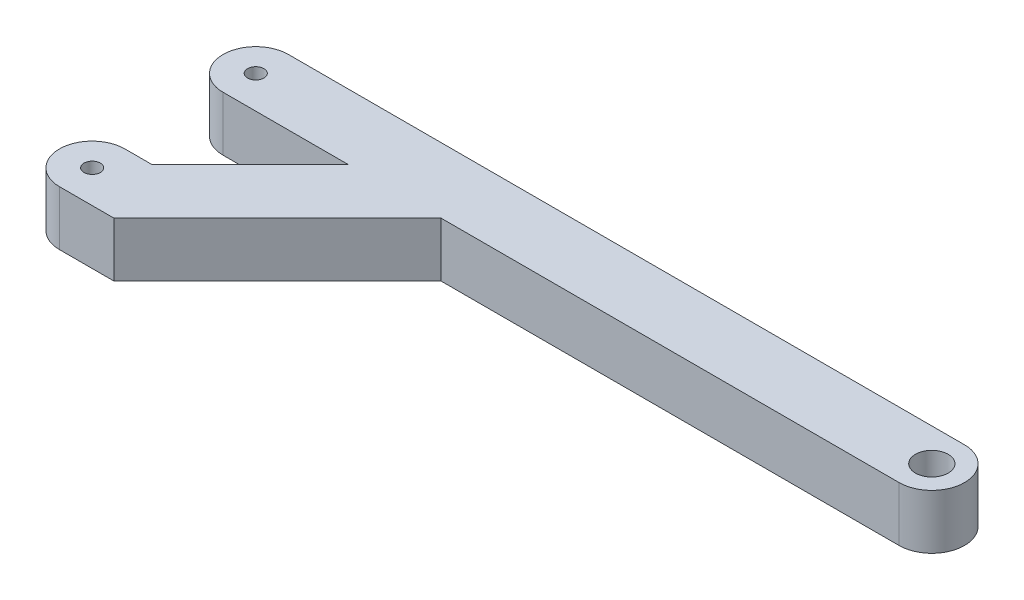
ISO-10303-21;
HEADER;
FILE_DESCRIPTION(('STEP AP214'),'2;1');
FILE_NAME('part.step','',(''),(''),'','','');
FILE_SCHEMA(('AUTOMOTIVE_DESIGN { 1 0 10303 214 1 1 1 1 }'));
ENDSEC;
DATA;
#1=APPLICATION_CONTEXT('core data for automotive mechanical design processes');
#2=APPLICATION_PROTOCOL_DEFINITION('international standard','automotive_design',2000,#1);
#3=PRODUCT_CONTEXT('',#1,'mechanical');
#4=PRODUCT('Part','Part','',(#3));
#5=PRODUCT_RELATED_PRODUCT_CATEGORY('part','',(#4));
#6=PRODUCT_DEFINITION_FORMATION('','',#4);
#7=PRODUCT_DEFINITION_CONTEXT('part definition',#1,'design');
#8=PRODUCT_DEFINITION('design','',#6,#7);
#9=PRODUCT_DEFINITION_SHAPE('','',#8);
#10=(LENGTH_UNIT() NAMED_UNIT(*) SI_UNIT(.MILLI.,.METRE.));
#11=(NAMED_UNIT(*) PLANE_ANGLE_UNIT() SI_UNIT($,.RADIAN.));
#12=(NAMED_UNIT(*) SI_UNIT($,.STERADIAN.) SOLID_ANGLE_UNIT());
#13=UNCERTAINTY_MEASURE_WITH_UNIT(LENGTH_MEASURE(1.E-05),#10,'distance_accuracy_value','');
#14=(GEOMETRIC_REPRESENTATION_CONTEXT(3) GLOBAL_UNCERTAINTY_ASSIGNED_CONTEXT((#13)) GLOBAL_UNIT_ASSIGNED_CONTEXT((#10,
#11,#12)) REPRESENTATION_CONTEXT('',''));
#15=CARTESIAN_POINT('',(0.,0.,0.));
#16=DIRECTION('',(0.,0.,1.));
#17=DIRECTION('',(1.,0.,0.));
#18=AXIS2_PLACEMENT_3D('',#15,#16,#17);
#19=CARTESIAN_POINT('',(0.,10.,6.));
#20=DIRECTION('',(0.,0.,-1.));
#21=DIRECTION('',(-1.,0.,0.));
#22=AXIS2_PLACEMENT_3D('',#19,#20,#21);
#23=PLANE('',#22);
#24=DIRECTION('',(0.,1.,0.));
#25=VECTOR('',#24,1.);
#26=CARTESIAN_POINT('',(-101.,-54.9181208709838,6.00000000000002));
#27=LINE('',#26,#25);
#28=CARTESIAN_POINT('',(-101.,0.,6.00000000000001));
#29=VERTEX_POINT('',#28);
#30=CARTESIAN_POINT('',(-101.,10.,6.00000000000001));
#31=VERTEX_POINT('',#30);
#32=EDGE_CURVE('E65',#29,#31,#27,.T.);
#33=ORIENTED_EDGE('',*,*,#32,.T.);
#34=DIRECTION('',(1.,0.,0.));
#35=VECTOR('',#34,1.);
#36=CARTESIAN_POINT('',(0.,10.,6.));
#37=LINE('',#36,#35);
#38=CARTESIAN_POINT('',(-124.,10.,6.00000000000002));
#39=VERTEX_POINT('',#38);
#40=EDGE_CURVE('E212',#39,#31,#37,.T.);
#41=ORIENTED_EDGE('',*,*,#40,.F.);
#42=DIRECTION('',(0.,-1.,0.));
#43=VECTOR('',#42,1.);
#44=CARTESIAN_POINT('',(-124.,10.,6.00000000000002));
#45=LINE('',#44,#43);
#46=CARTESIAN_POINT('',(-124.,0.,6.00000000000002));
#47=VERTEX_POINT('',#46);
#48=EDGE_CURVE('E231',#39,#47,#45,.T.);
#49=ORIENTED_EDGE('',*,*,#48,.T.);
#50=DIRECTION('',(1.,0.,0.));
#51=VECTOR('',#50,1.);
#52=CARTESIAN_POINT('',(0.,0.,6.));
#53=LINE('',#52,#51);
#54=EDGE_CURVE('E206',#47,#29,#53,.T.);
#55=ORIENTED_EDGE('',*,*,#54,.T.);
#56=EDGE_LOOP('',(#33,#41,#49,#55));
#57=FACE_BOUND('',#56,.T.);
#58=ADVANCED_FACE('F41',(#57),#23,.F.);
#59=CARTESIAN_POINT('',(0.,10.,0.));
#60=DIRECTION('',(0.,1.,0.));
#61=DIRECTION('',(0.,0.,1.));
#62=AXIS2_PLACEMENT_3D('',#59,#60,#61);
#63=PLANE('',#62);
#64=CARTESIAN_POINT('',(0.,10.,0.));
#65=DIRECTION('',(0.,1.,0.));
#66=DIRECTION('',(0.,0.,1.));
#67=AXIS2_PLACEMENT_3D('',#64,#65,#66);
#68=CIRCLE('',#67,3.);
#69=CARTESIAN_POINT('',(0.,10.,3.));
#70=VERTEX_POINT('',#69);
#71=EDGE_CURVE('E194',#70,#70,#68,.T.);
#72=ORIENTED_EDGE('',*,*,#71,.F.);
#73=EDGE_LOOP('',(#72));
#74=FACE_BOUND('',#73,.T.);
#75=CARTESIAN_POINT('',(0.,10.,0.));
#76=DIRECTION('',(0.,1.,0.));
#77=DIRECTION('',(0.,0.,1.));
#78=AXIS2_PLACEMENT_3D('',#75,#76,#77);
#79=CIRCLE('',#78,6.);
#80=CARTESIAN_POINT('',(0.,10.,6.));
#81=VERTEX_POINT('',#80);
#82=CARTESIAN_POINT('',(0.,10.,-6.));
#83=VERTEX_POINT('',#82);
#84=EDGE_CURVE('E202',#81,#83,#79,.T.);
#85=ORIENTED_EDGE('',*,*,#84,.T.);
#86=DIRECTION('',(-1.,0.,0.));
#87=VECTOR('',#86,1.);
#88=CARTESIAN_POINT('',(0.,10.,-6.));
#89=LINE('',#88,#87);
#90=CARTESIAN_POINT('',(-124.,10.,-6.));
#91=VERTEX_POINT('',#90);
#92=EDGE_CURVE('E205',#83,#91,#89,.T.);
#93=ORIENTED_EDGE('',*,*,#92,.T.);
#94=CARTESIAN_POINT('',(-124.,10.,0.));
#95=DIRECTION('',(0.,1.,0.));
#96=DIRECTION('',(0.,0.,1.));
#97=AXIS2_PLACEMENT_3D('',#94,#95,#96);
#98=CIRCLE('',#97,6.);
#99=EDGE_CURVE('E209',#91,#39,#98,.T.);
#100=ORIENTED_EDGE('',*,*,#99,.T.);
#101=ORIENTED_EDGE('',*,*,#40,.T.);
#102=DIRECTION('',(0.707106781186546,0.,-0.707106781186549));
#103=VECTOR('',#102,1.);
#104=CARTESIAN_POINT('',(-47.5000000000002,10.,-47.5));
#105=LINE('',#104,#103);
#106=CARTESIAN_POINT('',(-119.,10.,24.));
#107=VERTEX_POINT('',#106);
#108=EDGE_CURVE('E144',#107,#31,#105,.T.);
#109=ORIENTED_EDGE('',*,*,#108,.F.);
#110=DIRECTION('',(1.,0.,0.));
#111=VECTOR('',#110,1.);
#112=CARTESIAN_POINT('',(0.,10.,24.));
#113=LINE('',#112,#111);
#114=CARTESIAN_POINT('',(-124.,10.,24.));
#115=VERTEX_POINT('',#114);
#116=EDGE_CURVE('E126',#115,#107,#113,.T.);
#117=ORIENTED_EDGE('',*,*,#116,.F.);
#118=CARTESIAN_POINT('',(-124.,10.,30.));
#119=DIRECTION('',(0.,1.,0.));
#120=DIRECTION('',(0.,0.,1.));
#121=AXIS2_PLACEMENT_3D('',#118,#119,#120);
#122=CIRCLE('',#121,6.);
#123=CARTESIAN_POINT('',(-124.,10.,36.));
#124=VERTEX_POINT('',#123);
#125=EDGE_CURVE('E142',#115,#124,#122,.T.);
#126=ORIENTED_EDGE('',*,*,#125,.T.);
#127=DIRECTION('',(1.,0.,0.));
#128=VECTOR('',#127,1.);
#129=CARTESIAN_POINT('',(0.,10.,36.));
#130=LINE('',#129,#128);
#131=CARTESIAN_POINT('',(-114.,10.,36.));
#132=VERTEX_POINT('',#131);
#133=EDGE_CURVE('E151',#124,#132,#130,.T.);
#134=ORIENTED_EDGE('',*,*,#133,.T.);
#135=DIRECTION('',(0.707106781186546,0.,-0.707106781186549));
#136=VECTOR('',#135,1.);
#137=CARTESIAN_POINT('',(-39.0000000000002,10.,-39.0000000000001));
#138=LINE('',#137,#136);
#139=CARTESIAN_POINT('',(-84.0000000000001,10.,6.00000000000001));
#140=VERTEX_POINT('',#139);
#141=EDGE_CURVE('E154',#132,#140,#138,.T.);
#142=ORIENTED_EDGE('',*,*,#141,.T.);
#143=EDGE_CURVE('E57',#140,#81,#37,.T.);
#144=ORIENTED_EDGE('',*,*,#143,.T.);
#145=EDGE_LOOP('',(#85,#93,#100,#101,#109,#117,#126,#134,#142,#144));
#146=FACE_BOUND('',#145,.T.);
#147=CARTESIAN_POINT('',(-124.,10.,0.));
#148=DIRECTION('',(0.,1.,0.));
#149=DIRECTION('',(0.,0.,1.));
#150=AXIS2_PLACEMENT_3D('',#147,#148,#149);
#151=CIRCLE('',#150,1.5);
#152=CARTESIAN_POINT('',(-124.,10.,1.5));
#153=VERTEX_POINT('',#152);
#154=EDGE_CURVE('E186',#153,#153,#151,.T.);
#155=ORIENTED_EDGE('',*,*,#154,.F.);
#156=EDGE_LOOP('',(#155));
#157=FACE_BOUND('',#156,.T.);
#158=CARTESIAN_POINT('',(-124.,10.,30.));
#159=DIRECTION('',(0.,1.,0.));
#160=DIRECTION('',(0.,0.,1.));
#161=AXIS2_PLACEMENT_3D('',#158,#159,#160);
#162=CIRCLE('',#161,1.5);
#163=CARTESIAN_POINT('',(-124.,10.,31.5));
#164=VERTEX_POINT('',#163);
#165=EDGE_CURVE('E133',#164,#164,#162,.T.);
#166=ORIENTED_EDGE('',*,*,#165,.F.);
#167=EDGE_LOOP('',(#166));
#168=FACE_BOUND('',#167,.T.);
#169=ADVANCED_FACE('F139',(#74,#146,#157,#168),#63,.T.);
#170=CARTESIAN_POINT('',(0.,0.,0.));
#171=DIRECTION('',(0.,1.,0.));
#172=DIRECTION('',(0.,0.,1.));
#173=AXIS2_PLACEMENT_3D('',#170,#171,#172);
#174=PLANE('',#173);
#175=CARTESIAN_POINT('',(0.,0.,0.));
#176=DIRECTION('',(0.,1.,0.));
#177=DIRECTION('',(0.,0.,1.));
#178=AXIS2_PLACEMENT_3D('',#175,#176,#177);
#179=CIRCLE('',#178,6.);
#180=CARTESIAN_POINT('',(0.,0.,6.));
#181=VERTEX_POINT('',#180);
#182=CARTESIAN_POINT('',(0.,0.,-6.));
#183=VERTEX_POINT('',#182);
#184=EDGE_CURVE('E198',#181,#183,#179,.T.);
#185=ORIENTED_EDGE('',*,*,#184,.F.);
#186=CARTESIAN_POINT('',(-84.0000000000001,0.,6.00000000000002));
#187=VERTEX_POINT('',#186);
#188=EDGE_CURVE('E225',#187,#181,#53,.T.);
#189=ORIENTED_EDGE('',*,*,#188,.F.);
#190=DIRECTION('',(-0.707106781186546,0.,0.707106781186549));
#191=VECTOR('',#190,1.);
#192=CARTESIAN_POINT('',(-39.0000000000002,0.,-39.0000000000001));
#193=LINE('',#192,#191);
#194=CARTESIAN_POINT('',(-114.,0.,36.));
#195=VERTEX_POINT('',#194);
#196=EDGE_CURVE('E254',#187,#195,#193,.T.);
#197=ORIENTED_EDGE('',*,*,#196,.T.);
#198=DIRECTION('',(-1.,0.,0.));
#199=VECTOR('',#198,1.);
#200=CARTESIAN_POINT('',(0.,0.,36.));
#201=LINE('',#200,#199);
#202=CARTESIAN_POINT('',(-124.,0.,36.));
#203=VERTEX_POINT('',#202);
#204=EDGE_CURVE('E169',#195,#203,#201,.T.);
#205=ORIENTED_EDGE('',*,*,#204,.T.);
#206=CARTESIAN_POINT('',(-124.,0.,30.));
#207=DIRECTION('',(0.,1.,0.));
#208=DIRECTION('',(0.,0.,1.));
#209=AXIS2_PLACEMENT_3D('',#206,#207,#208);
#210=CIRCLE('',#209,6.);
#211=CARTESIAN_POINT('',(-124.,0.,24.));
#212=VERTEX_POINT('',#211);
#213=EDGE_CURVE('E185',#203,#212,#210,.F.);
#214=ORIENTED_EDGE('',*,*,#213,.T.);
#215=DIRECTION('',(-1.,0.,0.));
#216=VECTOR('',#215,1.);
#217=CARTESIAN_POINT('',(0.,0.,24.));
#218=LINE('',#217,#216);
#219=CARTESIAN_POINT('',(-119.,0.,24.));
#220=VERTEX_POINT('',#219);
#221=EDGE_CURVE('E127',#220,#212,#218,.T.);
#222=ORIENTED_EDGE('',*,*,#221,.F.);
#223=DIRECTION('',(-0.707106781186546,0.,0.707106781186549));
#224=VECTOR('',#223,1.);
#225=CARTESIAN_POINT('',(-47.5000000000002,0.,-47.5));
#226=LINE('',#225,#224);
#227=EDGE_CURVE('E250',#29,#220,#226,.T.);
#228=ORIENTED_EDGE('',*,*,#227,.F.);
#229=ORIENTED_EDGE('',*,*,#54,.F.);
#230=CARTESIAN_POINT('',(-124.,0.,0.));
#231=DIRECTION('',(0.,1.,0.));
#232=DIRECTION('',(0.,0.,1.));
#233=AXIS2_PLACEMENT_3D('',#230,#231,#232);
#234=CIRCLE('',#233,6.);
#235=CARTESIAN_POINT('',(-124.,0.,-6.));
#236=VERTEX_POINT('',#235);
#237=EDGE_CURVE('E222',#236,#47,#234,.T.);
#238=ORIENTED_EDGE('',*,*,#237,.F.);
#239=DIRECTION('',(-1.,0.,0.));
#240=VECTOR('',#239,1.);
#241=CARTESIAN_POINT('',(0.,0.,-6.));
#242=LINE('',#241,#240);
#243=EDGE_CURVE('E219',#183,#236,#242,.T.);
#244=ORIENTED_EDGE('',*,*,#243,.F.);
#245=EDGE_LOOP('',(#185,#189,#197,#205,#214,#222,#228,#229,#238,#244));
#246=FACE_BOUND('',#245,.T.);
#247=CARTESIAN_POINT('',(0.,0.,0.));
#248=DIRECTION('',(0.,1.,0.));
#249=DIRECTION('',(0.,0.,1.));
#250=AXIS2_PLACEMENT_3D('',#247,#248,#249);
#251=CIRCLE('',#250,3.);
#252=CARTESIAN_POINT('',(0.,0.,3.));
#253=VERTEX_POINT('',#252);
#254=EDGE_CURVE('E190',#253,#253,#251,.T.);
#255=ORIENTED_EDGE('',*,*,#254,.T.);
#256=EDGE_LOOP('',(#255));
#257=FACE_BOUND('',#256,.T.);
#258=CARTESIAN_POINT('',(-124.,0.,0.));
#259=DIRECTION('',(0.,1.,0.));
#260=DIRECTION('',(0.,0.,1.));
#261=AXIS2_PLACEMENT_3D('',#258,#259,#260);
#262=CIRCLE('',#261,1.5);
#263=CARTESIAN_POINT('',(-124.,0.,1.5));
#264=VERTEX_POINT('',#263);
#265=EDGE_CURVE('E184',#264,#264,#262,.T.);
#266=ORIENTED_EDGE('',*,*,#265,.T.);
#267=EDGE_LOOP('',(#266));
#268=FACE_BOUND('',#267,.T.);
#269=CARTESIAN_POINT('',(-124.,0.,30.));
#270=DIRECTION('',(0.,1.,0.));
#271=DIRECTION('',(0.,0.,1.));
#272=AXIS2_PLACEMENT_3D('',#269,#270,#271);
#273=CIRCLE('',#272,1.5);
#274=CARTESIAN_POINT('',(-124.,0.,31.5));
#275=VERTEX_POINT('',#274);
#276=EDGE_CURVE('E180',#275,#275,#273,.F.);
#277=ORIENTED_EDGE('',*,*,#276,.F.);
#278=EDGE_LOOP('',(#277));
#279=FACE_BOUND('',#278,.T.);
#280=ADVANCED_FACE('F246',(#246,#257,#268,#279),#174,.F.);
#281=CARTESIAN_POINT('',(0.,10.,0.));
#282=DIRECTION('',(0.,-1.,0.));
#283=DIRECTION('',(0.,0.,-1.));
#284=AXIS2_PLACEMENT_3D('',#281,#282,#283);
#285=CYLINDRICAL_SURFACE('',#284,6.);
#286=ORIENTED_EDGE('',*,*,#184,.T.);
#287=DIRECTION('',(0.,-1.,0.));
#288=VECTOR('',#287,1.);
#289=CARTESIAN_POINT('',(0.,10.,-6.));
#290=LINE('',#289,#288);
#291=EDGE_CURVE('E11',#83,#183,#290,.T.);
#292=ORIENTED_EDGE('',*,*,#291,.F.);
#293=ORIENTED_EDGE('',*,*,#84,.F.);
#294=DIRECTION('',(0.,-1.,0.));
#295=VECTOR('',#294,1.);
#296=CARTESIAN_POINT('',(0.,10.,6.));
#297=LINE('',#296,#295);
#298=EDGE_CURVE('E215',#81,#181,#297,.T.);
#299=ORIENTED_EDGE('',*,*,#298,.T.);
#300=EDGE_LOOP('',(#286,#292,#293,#299));
#301=FACE_BOUND('',#300,.T.);
#302=ADVANCED_FACE('F43',(#301),#285,.T.);
#303=CARTESIAN_POINT('',(0.,10.,-6.));
#304=DIRECTION('',(0.,0.,1.));
#305=DIRECTION('',(1.,0.,0.));
#306=AXIS2_PLACEMENT_3D('',#303,#304,#305);
#307=PLANE('',#306);
#308=ORIENTED_EDGE('',*,*,#243,.T.);
#309=DIRECTION('',(0.,-1.,0.));
#310=VECTOR('',#309,1.);
#311=CARTESIAN_POINT('',(-124.,10.,-6.));
#312=LINE('',#311,#310);
#313=EDGE_CURVE('E50',#91,#236,#312,.T.);
#314=ORIENTED_EDGE('',*,*,#313,.F.);
#315=ORIENTED_EDGE('',*,*,#92,.F.);
#316=ORIENTED_EDGE('',*,*,#291,.T.);
#317=EDGE_LOOP('',(#308,#314,#315,#316));
#318=FACE_BOUND('',#317,.T.);
#319=ADVANCED_FACE('F276',(#318),#307,.F.);
#320=CARTESIAN_POINT('',(-124.,10.,0.));
#321=DIRECTION('',(0.,-1.,0.));
#322=DIRECTION('',(0.,0.,-1.));
#323=AXIS2_PLACEMENT_3D('',#320,#321,#322);
#324=CYLINDRICAL_SURFACE('',#323,6.);
#325=ORIENTED_EDGE('',*,*,#237,.T.);
#326=ORIENTED_EDGE('',*,*,#48,.F.);
#327=ORIENTED_EDGE('',*,*,#99,.F.);
#328=ORIENTED_EDGE('',*,*,#313,.T.);
#329=EDGE_LOOP('',(#325,#326,#327,#328));
#330=FACE_BOUND('',#329,.T.);
#331=ADVANCED_FACE('F240',(#330),#324,.T.);
#332=ORIENTED_EDGE('',*,*,#143,.F.);
#333=DIRECTION('',(0.,1.,0.));
#334=VECTOR('',#333,1.);
#335=CARTESIAN_POINT('',(-84.0000000000001,-54.9181208709838,6.00000000000001));
#336=LINE('',#335,#334);
#337=EDGE_CURVE('E172',#187,#140,#336,.T.);
#338=ORIENTED_EDGE('',*,*,#337,.F.);
#339=ORIENTED_EDGE('',*,*,#188,.T.);
#340=ORIENTED_EDGE('',*,*,#298,.F.);
#341=EDGE_LOOP('',(#332,#338,#339,#340));
#342=FACE_BOUND('',#341,.T.);
#343=ADVANCED_FACE('F271',(#342),#23,.F.);
#344=CARTESIAN_POINT('',(0.,10.,0.));
#345=DIRECTION('',(0.,-1.,0.));
#346=DIRECTION('',(0.,0.,-1.));
#347=AXIS2_PLACEMENT_3D('',#344,#345,#346);
#348=CYLINDRICAL_SURFACE('',#347,3.);
#349=ORIENTED_EDGE('',*,*,#71,.T.);
#350=EDGE_LOOP('',(#349));
#351=FACE_BOUND('',#350,.T.);
#352=ORIENTED_EDGE('',*,*,#254,.F.);
#353=EDGE_LOOP('',(#352));
#354=FACE_BOUND('',#353,.T.);
#355=ADVANCED_FACE('F294',(#351,#354),#348,.F.);
#356=CARTESIAN_POINT('',(-124.,10.,0.));
#357=DIRECTION('',(0.,-1.,0.));
#358=DIRECTION('',(0.,0.,-1.));
#359=AXIS2_PLACEMENT_3D('',#356,#357,#358);
#360=CYLINDRICAL_SURFACE('',#359,1.5);
#361=ORIENTED_EDGE('',*,*,#154,.T.);
#362=EDGE_LOOP('',(#361));
#363=FACE_BOUND('',#362,.T.);
#364=ORIENTED_EDGE('',*,*,#265,.F.);
#365=EDGE_LOOP('',(#364));
#366=FACE_BOUND('',#365,.T.);
#367=ADVANCED_FACE('F300',(#363,#366),#360,.F.);
#368=CARTESIAN_POINT('',(-124.,-54.9181208709838,30.));
#369=DIRECTION('',(0.,1.,0.));
#370=DIRECTION('',(0.,0.,1.));
#371=AXIS2_PLACEMENT_3D('',#368,#369,#370);
#372=CYLINDRICAL_SURFACE('',#371,6.);
#373=ORIENTED_EDGE('',*,*,#213,.F.);
#374=DIRECTION('',(0.,1.,0.));
#375=VECTOR('',#374,1.);
#376=CARTESIAN_POINT('',(-124.,-54.9181208709838,36.));
#377=LINE('',#376,#375);
#378=EDGE_CURVE('E132',#203,#124,#377,.T.);
#379=ORIENTED_EDGE('',*,*,#378,.T.);
#380=ORIENTED_EDGE('',*,*,#125,.F.);
#381=DIRECTION('',(0.,1.,0.));
#382=VECTOR('',#381,1.);
#383=CARTESIAN_POINT('',(-124.,-54.9181208709838,24.));
#384=LINE('',#383,#382);
#385=EDGE_CURVE('E122',#212,#115,#384,.T.);
#386=ORIENTED_EDGE('',*,*,#385,.F.);
#387=EDGE_LOOP('',(#373,#379,#380,#386));
#388=FACE_BOUND('',#387,.T.);
#389=ADVANCED_FACE('F147',(#388),#372,.T.);
#390=CARTESIAN_POINT('',(0.,-54.9181208709838,36.));
#391=DIRECTION('',(0.,0.,1.));
#392=DIRECTION('',(1.,0.,0.));
#393=AXIS2_PLACEMENT_3D('',#390,#391,#392);
#394=PLANE('',#393);
#395=ORIENTED_EDGE('',*,*,#204,.F.);
#396=DIRECTION('',(0.,1.,0.));
#397=VECTOR('',#396,1.);
#398=CARTESIAN_POINT('',(-114.,-54.9181208709838,36.));
#399=LINE('',#398,#397);
#400=EDGE_CURVE('E175',#195,#132,#399,.T.);
#401=ORIENTED_EDGE('',*,*,#400,.T.);
#402=ORIENTED_EDGE('',*,*,#133,.F.);
#403=ORIENTED_EDGE('',*,*,#378,.F.);
#404=EDGE_LOOP('',(#395,#401,#402,#403));
#405=FACE_BOUND('',#404,.T.);
#406=ADVANCED_FACE('F267',(#405),#394,.T.);
#407=CARTESIAN_POINT('',(-39.0000000000002,-54.9181208709838,-39.0000000000001));
#408=DIRECTION('',(0.707106781186549,0.,0.707106781186546));
#409=DIRECTION('',(0.707106781186546,0.,-0.707106781186549));
#410=AXIS2_PLACEMENT_3D('',#407,#408,#409);
#411=PLANE('',#410);
#412=ORIENTED_EDGE('',*,*,#196,.F.);
#413=ORIENTED_EDGE('',*,*,#337,.T.);
#414=ORIENTED_EDGE('',*,*,#141,.F.);
#415=ORIENTED_EDGE('',*,*,#400,.F.);
#416=EDGE_LOOP('',(#412,#413,#414,#415));
#417=FACE_BOUND('',#416,.T.);
#418=ADVANCED_FACE('F270',(#417),#411,.T.);
#419=CARTESIAN_POINT('',(-47.5000000000002,-54.9181208709838,-47.5));
#420=DIRECTION('',(0.707106781186549,0.,0.707106781186546));
#421=DIRECTION('',(0.707106781186546,0.,-0.707106781186549));
#422=AXIS2_PLACEMENT_3D('',#419,#420,#421);
#423=PLANE('',#422);
#424=ORIENTED_EDGE('',*,*,#32,.F.);
#425=ORIENTED_EDGE('',*,*,#227,.T.);
#426=DIRECTION('',(0.,1.,0.));
#427=VECTOR('',#426,1.);
#428=CARTESIAN_POINT('',(-119.,-54.9181208709838,24.));
#429=LINE('',#428,#427);
#430=EDGE_CURVE('E166',#220,#107,#429,.T.);
#431=ORIENTED_EDGE('',*,*,#430,.T.);
#432=ORIENTED_EDGE('',*,*,#108,.T.);
#433=EDGE_LOOP('',(#424,#425,#431,#432));
#434=FACE_BOUND('',#433,.T.);
#435=ADVANCED_FACE('F252',(#434),#423,.F.);
#436=CARTESIAN_POINT('',(0.,-54.9181208709838,24.));
#437=DIRECTION('',(0.,0.,1.));
#438=DIRECTION('',(1.,0.,0.));
#439=AXIS2_PLACEMENT_3D('',#436,#437,#438);
#440=PLANE('',#439);
#441=ORIENTED_EDGE('',*,*,#430,.F.);
#442=ORIENTED_EDGE('',*,*,#221,.T.);
#443=ORIENTED_EDGE('',*,*,#385,.T.);
#444=ORIENTED_EDGE('',*,*,#116,.T.);
#445=EDGE_LOOP('',(#441,#442,#443,#444));
#446=FACE_BOUND('',#445,.T.);
#447=ADVANCED_FACE('F125',(#446),#440,.F.);
#448=CARTESIAN_POINT('',(-124.,-54.9181208709838,30.));
#449=DIRECTION('',(0.,1.,0.));
#450=DIRECTION('',(0.,0.,1.));
#451=AXIS2_PLACEMENT_3D('',#448,#449,#450);
#452=CYLINDRICAL_SURFACE('',#451,1.5);
#453=ORIENTED_EDGE('',*,*,#276,.T.);
#454=EDGE_LOOP('',(#453));
#455=FACE_BOUND('',#454,.T.);
#456=ORIENTED_EDGE('',*,*,#165,.T.);
#457=EDGE_LOOP('',(#456));
#458=FACE_BOUND('',#457,.T.);
#459=ADVANCED_FACE('F343',(#455,#458),#452,.F.);
#460=CLOSED_SHELL('',(#58,#169,#280,#302,#319,#331,#343,#355,#367,#389,#406,#418,#435,#447,#459));
#461=MANIFOLD_SOLID_BREP('B2',#460);
#462=ADVANCED_BREP_SHAPE_REPRESENTATION('',(#18,#461),#14);
#463=SHAPE_DEFINITION_REPRESENTATION(#9,#462);
ENDSEC;
END-ISO-10303-21;
